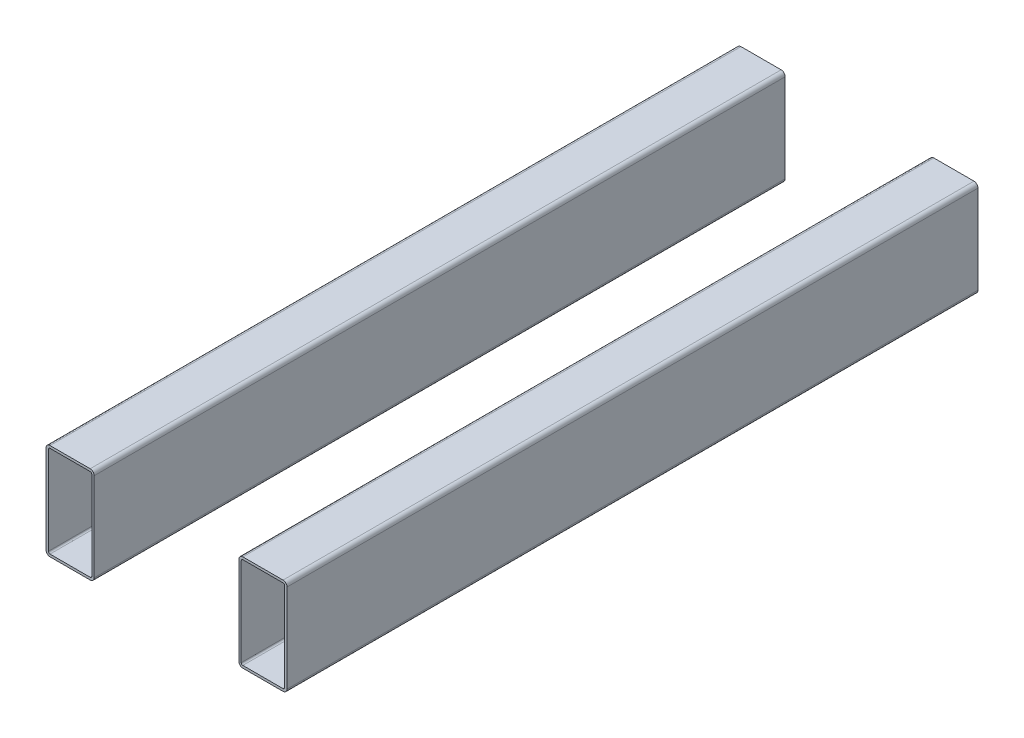
ISO-10303-21;
HEADER;
FILE_DESCRIPTION(('STEP AP214'),'2;1');
FILE_NAME('part.step','',(''),(''),'','','');
FILE_SCHEMA(('AUTOMOTIVE_DESIGN { 1 0 10303 214 1 1 1 1 }'));
ENDSEC;
DATA;
#1=APPLICATION_CONTEXT('core data for automotive mechanical design processes');
#2=APPLICATION_PROTOCOL_DEFINITION('international standard','automotive_design',2000,#1);
#3=PRODUCT_CONTEXT('',#1,'mechanical');
#4=PRODUCT('Part','Part','',(#3));
#5=PRODUCT_RELATED_PRODUCT_CATEGORY('part','',(#4));
#6=PRODUCT_DEFINITION_FORMATION('','',#4);
#7=PRODUCT_DEFINITION_CONTEXT('part definition',#1,'design');
#8=PRODUCT_DEFINITION('design','',#6,#7);
#9=PRODUCT_DEFINITION_SHAPE('','',#8);
#10=(LENGTH_UNIT() NAMED_UNIT(*) SI_UNIT(.MILLI.,.METRE.));
#11=(NAMED_UNIT(*) PLANE_ANGLE_UNIT() SI_UNIT($,.RADIAN.));
#12=(NAMED_UNIT(*) SI_UNIT($,.STERADIAN.) SOLID_ANGLE_UNIT());
#13=UNCERTAINTY_MEASURE_WITH_UNIT(LENGTH_MEASURE(1.E-05),#10,'distance_accuracy_value','');
#14=(GEOMETRIC_REPRESENTATION_CONTEXT(3) GLOBAL_UNCERTAINTY_ASSIGNED_CONTEXT((#13)) GLOBAL_UNIT_ASSIGNED_CONTEXT((#10,
#11,#12)) REPRESENTATION_CONTEXT('',''));
#15=CARTESIAN_POINT('',(0.,0.,0.));
#16=DIRECTION('',(0.,0.,1.));
#17=DIRECTION('',(1.,0.,0.));
#18=AXIS2_PLACEMENT_3D('',#15,#16,#17);
#19=CARTESIAN_POINT('',(-150.,-1294.,-564.164078649986));
#20=DIRECTION('',(-1.,0.,0.));
#21=DIRECTION('',(0.,-1.,0.));
#22=AXIS2_PLACEMENT_3D('',#19,#20,#21);
#23=PLANE('',#22);
#24=DIRECTION('',(0.,-1.,0.));
#25=VECTOR('',#24,1.);
#26=CARTESIAN_POINT('',(-150.,-1294.,-429.999999999999));
#27=LINE('',#26,#25);
#28=CARTESIAN_POINT('',(-150.,-1299.,-429.999999999999));
#29=VERTEX_POINT('',#28);
#30=CARTESIAN_POINT('',(-150.,-1409.,-429.999999999999));
#31=VERTEX_POINT('',#30);
#32=EDGE_CURVE('E247',#29,#31,#27,.T.);
#33=ORIENTED_EDGE('',*,*,#32,.T.);
#34=DIRECTION('',(0.,0.,1.));
#35=VECTOR('',#34,1.);
#36=CARTESIAN_POINT('',(-150.,-1409.,-564.164078649986));
#37=LINE('',#36,#35);
#38=CARTESIAN_POINT('',(-150.,-1409.,429.999999999999));
#39=VERTEX_POINT('',#38);
#40=EDGE_CURVE('E266',#31,#39,#37,.T.);
#41=ORIENTED_EDGE('',*,*,#40,.T.);
#42=DIRECTION('',(0.,1.,0.));
#43=VECTOR('',#42,1.);
#44=CARTESIAN_POINT('',(-150.,-1294.,429.999999999999));
#45=LINE('',#44,#43);
#46=CARTESIAN_POINT('',(-150.,-1299.,429.999999999999));
#47=VERTEX_POINT('',#46);
#48=EDGE_CURVE('E253',#39,#47,#45,.T.);
#49=ORIENTED_EDGE('',*,*,#48,.T.);
#50=DIRECTION('',(0.,0.,1.));
#51=VECTOR('',#50,1.);
#52=CARTESIAN_POINT('',(-150.,-1299.,-429.999999999999));
#53=LINE('',#52,#51);
#54=EDGE_CURVE('E256',#47,#29,#53,.F.);
#55=ORIENTED_EDGE('',*,*,#54,.T.);
#56=EDGE_LOOP('',(#33,#41,#49,#55));
#57=FACE_BOUND('',#56,.T.);
#58=ADVANCED_FACE('F71',(#57),#23,.T.);
#59=CARTESIAN_POINT('',(-150.,-1414.,-564.164078649986));
#60=DIRECTION('',(0.,-1.,0.));
#61=DIRECTION('',(0.,0.,-1.));
#62=AXIS2_PLACEMENT_3D('',#59,#60,#61);
#63=PLANE('',#62);
#64=DIRECTION('',(-1.,0.,0.));
#65=VECTOR('',#64,1.);
#66=CARTESIAN_POINT('',(-150.,-1414.,429.999999999999));
#67=LINE('',#66,#65);
#68=CARTESIAN_POINT('',(-95.,-1414.,429.999999999999));
#69=VERTEX_POINT('',#68);
#70=CARTESIAN_POINT('',(-145.,-1414.,429.999999999999));
#71=VERTEX_POINT('',#70);
#72=EDGE_CURVE('E257',#69,#71,#67,.T.);
#73=ORIENTED_EDGE('',*,*,#72,.T.);
#74=DIRECTION('',(0.,0.,1.));
#75=VECTOR('',#74,1.);
#76=CARTESIAN_POINT('',(-145.,-1414.,-564.164078649986));
#77=LINE('',#76,#75);
#78=CARTESIAN_POINT('',(-145.,-1414.,-429.999999999999));
#79=VERTEX_POINT('',#78);
#80=EDGE_CURVE('E280',#71,#79,#77,.F.);
#81=ORIENTED_EDGE('',*,*,#80,.T.);
#82=DIRECTION('',(1.,0.,0.));
#83=VECTOR('',#82,1.);
#84=CARTESIAN_POINT('',(-150.,-1414.,-429.999999999999));
#85=LINE('',#84,#83);
#86=CARTESIAN_POINT('',(-95.,-1414.,-429.999999999999));
#87=VERTEX_POINT('',#86);
#88=EDGE_CURVE('E244',#79,#87,#85,.T.);
#89=ORIENTED_EDGE('',*,*,#88,.T.);
#90=DIRECTION('',(0.,0.,1.));
#91=VECTOR('',#90,1.);
#92=CARTESIAN_POINT('',(-95.,-1414.,429.999999999999));
#93=LINE('',#92,#91);
#94=EDGE_CURVE('E277',#87,#69,#93,.T.);
#95=ORIENTED_EDGE('',*,*,#94,.T.);
#96=EDGE_LOOP('',(#73,#81,#89,#95));
#97=FACE_BOUND('',#96,.T.);
#98=ADVANCED_FACE('F365',(#97),#63,.T.);
#99=CARTESIAN_POINT('',(-90.,-1294.,-564.164078649986));
#100=DIRECTION('',(-1.,0.,0.));
#101=DIRECTION('',(0.,-1.,0.));
#102=AXIS2_PLACEMENT_3D('',#99,#100,#101);
#103=PLANE('',#102);
#104=DIRECTION('',(0.,1.,0.));
#105=VECTOR('',#104,1.);
#106=CARTESIAN_POINT('',(-90.,-1294.,429.999999999999));
#107=LINE('',#106,#105);
#108=CARTESIAN_POINT('',(-90.,-1409.,429.999999999999));
#109=VERTEX_POINT('',#108);
#110=CARTESIAN_POINT('',(-90.,-1299.,429.999999999999));
#111=VERTEX_POINT('',#110);
#112=EDGE_CURVE('E258',#109,#111,#107,.T.);
#113=ORIENTED_EDGE('',*,*,#112,.F.);
#114=DIRECTION('',(0.,0.,1.));
#115=VECTOR('',#114,1.);
#116=CARTESIAN_POINT('',(-90.,-1409.,-429.999999999999));
#117=LINE('',#116,#115);
#118=CARTESIAN_POINT('',(-90.,-1409.,-429.999999999999));
#119=VERTEX_POINT('',#118);
#120=EDGE_CURVE('E293',#109,#119,#117,.F.);
#121=ORIENTED_EDGE('',*,*,#120,.T.);
#122=DIRECTION('',(0.,-1.,0.));
#123=VECTOR('',#122,1.);
#124=CARTESIAN_POINT('',(-90.,-1294.,-429.999999999999));
#125=LINE('',#124,#123);
#126=CARTESIAN_POINT('',(-90.,-1299.,-429.999999999999));
#127=VERTEX_POINT('',#126);
#128=EDGE_CURVE('E243',#127,#119,#125,.T.);
#129=ORIENTED_EDGE('',*,*,#128,.F.);
#130=DIRECTION('',(0.,0.,1.));
#131=VECTOR('',#130,1.);
#132=CARTESIAN_POINT('',(-90.,-1299.,-564.164078649986));
#133=LINE('',#132,#131);
#134=EDGE_CURVE('E290',#127,#111,#133,.T.);
#135=ORIENTED_EDGE('',*,*,#134,.T.);
#136=EDGE_LOOP('',(#113,#121,#129,#135));
#137=FACE_BOUND('',#136,.T.);
#138=ADVANCED_FACE('F361',(#137),#103,.F.);
#139=CARTESIAN_POINT('',(-150.,-1294.,-564.164078649986));
#140=DIRECTION('',(0.,-1.,0.));
#141=DIRECTION('',(0.,0.,-1.));
#142=AXIS2_PLACEMENT_3D('',#139,#140,#141);
#143=PLANE('',#142);
#144=DIRECTION('',(1.,0.,0.));
#145=VECTOR('',#144,1.);
#146=CARTESIAN_POINT('',(-150.,-1294.,-429.999999999999));
#147=LINE('',#146,#145);
#148=CARTESIAN_POINT('',(-145.,-1294.,-429.999999999999));
#149=VERTEX_POINT('',#148);
#150=CARTESIAN_POINT('',(-95.,-1294.,-429.999999999999));
#151=VERTEX_POINT('',#150);
#152=EDGE_CURVE('E223',#149,#151,#147,.T.);
#153=ORIENTED_EDGE('',*,*,#152,.F.);
#154=DIRECTION('',(0.,0.,1.));
#155=VECTOR('',#154,1.);
#156=CARTESIAN_POINT('',(-145.,-1294.,429.999999999999));
#157=LINE('',#156,#155);
#158=CARTESIAN_POINT('',(-145.,-1294.,429.999999999999));
#159=VERTEX_POINT('',#158);
#160=EDGE_CURVE('E297',#149,#159,#157,.T.);
#161=ORIENTED_EDGE('',*,*,#160,.T.);
#162=DIRECTION('',(-1.,0.,0.));
#163=VECTOR('',#162,1.);
#164=CARTESIAN_POINT('',(-150.,-1294.,429.999999999999));
#165=LINE('',#164,#163);
#166=CARTESIAN_POINT('',(-95.,-1294.,429.999999999999));
#167=VERTEX_POINT('',#166);
#168=EDGE_CURVE('E250',#167,#159,#165,.T.);
#169=ORIENTED_EDGE('',*,*,#168,.F.);
#170=DIRECTION('',(0.,0.,1.));
#171=VECTOR('',#170,1.);
#172=CARTESIAN_POINT('',(-95.,-1294.,-564.164078649986));
#173=LINE('',#172,#171);
#174=EDGE_CURVE('E295',#167,#151,#173,.F.);
#175=ORIENTED_EDGE('',*,*,#174,.T.);
#176=EDGE_LOOP('',(#153,#161,#169,#175));
#177=FACE_BOUND('',#176,.T.);
#178=ADVANCED_FACE('F330',(#177),#143,.F.);
#179=CARTESIAN_POINT('',(1.73275416638304E-05,-1429.,-429.999999999999));
#180=DIRECTION('',(0.,0.,-1.));
#181=DIRECTION('',(-1.,0.,0.));
#182=AXIS2_PLACEMENT_3D('',#179,#180,#181);
#183=PLANE('',#182);
#184=CARTESIAN_POINT('',(-95.,-1409.,-429.999999999999));
#185=DIRECTION('',(0.,0.,-1.));
#186=DIRECTION('',(-1.,0.,0.));
#187=AXIS2_PLACEMENT_3D('',#184,#185,#186);
#188=CIRCLE('',#187,2.);
#189=CARTESIAN_POINT('',(-93.,-1409.,-429.999999999999));
#190=VERTEX_POINT('',#189);
#191=CARTESIAN_POINT('',(-95.,-1411.,-429.999999999999));
#192=VERTEX_POINT('',#191);
#193=EDGE_CURVE('E188',#190,#192,#188,.T.);
#194=ORIENTED_EDGE('',*,*,#193,.F.);
#195=DIRECTION('',(0.,-1.,0.));
#196=VECTOR('',#195,1.);
#197=CARTESIAN_POINT('',(-93.0000000000001,-1299.,-429.999999999999));
#198=LINE('',#197,#196);
#199=CARTESIAN_POINT('',(-93.,-1299.,-429.999999999999));
#200=VERTEX_POINT('',#199);
#201=EDGE_CURVE('E204',#200,#190,#198,.T.);
#202=ORIENTED_EDGE('',*,*,#201,.F.);
#203=CARTESIAN_POINT('',(-95.,-1299.,-429.999999999999));
#204=DIRECTION('',(0.,0.,-1.));
#205=DIRECTION('',(-1.,0.,0.));
#206=AXIS2_PLACEMENT_3D('',#203,#204,#205);
#207=CIRCLE('',#206,1.99999999999997);
#208=CARTESIAN_POINT('',(-95.,-1297.,-429.999999999999));
#209=VERTEX_POINT('',#208);
#210=EDGE_CURVE('E207',#209,#200,#207,.T.);
#211=ORIENTED_EDGE('',*,*,#210,.F.);
#212=DIRECTION('',(1.,0.,0.));
#213=VECTOR('',#212,1.);
#214=CARTESIAN_POINT('',(-145.,-1297.,-429.999999999999));
#215=LINE('',#214,#213);
#216=CARTESIAN_POINT('',(-145.,-1297.,-429.999999999999));
#217=VERTEX_POINT('',#216);
#218=EDGE_CURVE('E236',#217,#209,#215,.T.);
#219=ORIENTED_EDGE('',*,*,#218,.F.);
#220=CARTESIAN_POINT('',(-145.,-1299.,-429.999999999999));
#221=DIRECTION('',(0.,0.,-1.));
#222=DIRECTION('',(-1.,0.,0.));
#223=AXIS2_PLACEMENT_3D('',#220,#221,#222);
#224=CIRCLE('',#223,2.);
#225=CARTESIAN_POINT('',(-147.,-1299.,-429.999999999999));
#226=VERTEX_POINT('',#225);
#227=EDGE_CURVE('E233',#226,#217,#224,.T.);
#228=ORIENTED_EDGE('',*,*,#227,.F.);
#229=DIRECTION('',(0.,1.,0.));
#230=VECTOR('',#229,1.);
#231=CARTESIAN_POINT('',(-147.,-1409.,-429.999999999999));
#232=LINE('',#231,#230);
#233=CARTESIAN_POINT('',(-147.,-1409.,-429.999999999999));
#234=VERTEX_POINT('',#233);
#235=EDGE_CURVE('E230',#234,#226,#232,.T.);
#236=ORIENTED_EDGE('',*,*,#235,.F.);
#237=CARTESIAN_POINT('',(-145.,-1409.,-429.999999999999));
#238=DIRECTION('',(0.,0.,-1.));
#239=DIRECTION('',(-1.,0.,0.));
#240=AXIS2_PLACEMENT_3D('',#237,#238,#239);
#241=CIRCLE('',#240,1.99999999999997);
#242=CARTESIAN_POINT('',(-145.,-1411.,-429.999999999999));
#243=VERTEX_POINT('',#242);
#244=EDGE_CURVE('E227',#243,#234,#241,.T.);
#245=ORIENTED_EDGE('',*,*,#244,.F.);
#246=DIRECTION('',(-1.,0.,0.));
#247=VECTOR('',#246,1.);
#248=CARTESIAN_POINT('',(-95.,-1411.,-429.999999999999));
#249=LINE('',#248,#247);
#250=EDGE_CURVE('E225',#192,#243,#249,.T.);
#251=ORIENTED_EDGE('',*,*,#250,.F.);
#252=EDGE_LOOP('',(#194,#202,#211,#219,#228,#236,#245,#251));
#253=FACE_BOUND('',#252,.T.);
#254=ORIENTED_EDGE('',*,*,#88,.F.);
#255=CARTESIAN_POINT('',(-145.,-1409.,-429.999999999999));
#256=DIRECTION('',(0.,0.,-1.));
#257=DIRECTION('',(-1.,0.,0.));
#258=AXIS2_PLACEMENT_3D('',#255,#256,#257);
#259=CIRCLE('',#258,5.);
#260=EDGE_CURVE('E288',#79,#31,#259,.T.);
#261=ORIENTED_EDGE('',*,*,#260,.T.);
#262=ORIENTED_EDGE('',*,*,#32,.F.);
#263=CARTESIAN_POINT('',(-145.,-1299.,-429.999999999999));
#264=DIRECTION('',(0.,0.,-1.));
#265=DIRECTION('',(-1.,0.,0.));
#266=AXIS2_PLACEMENT_3D('',#263,#264,#265);
#267=CIRCLE('',#266,5.);
#268=EDGE_CURVE('E284',#29,#149,#267,.T.);
#269=ORIENTED_EDGE('',*,*,#268,.T.);
#270=ORIENTED_EDGE('',*,*,#152,.T.);
#271=CARTESIAN_POINT('',(-95.,-1299.,-429.999999999999));
#272=DIRECTION('',(0.,0.,-1.));
#273=DIRECTION('',(-1.,0.,0.));
#274=AXIS2_PLACEMENT_3D('',#271,#272,#273);
#275=CIRCLE('',#274,5.);
#276=EDGE_CURVE('E282',#151,#127,#275,.T.);
#277=ORIENTED_EDGE('',*,*,#276,.T.);
#278=ORIENTED_EDGE('',*,*,#128,.T.);
#279=CARTESIAN_POINT('',(-95.,-1409.,-429.999999999999));
#280=DIRECTION('',(0.,0.,-1.));
#281=DIRECTION('',(-1.,0.,0.));
#282=AXIS2_PLACEMENT_3D('',#279,#280,#281);
#283=CIRCLE('',#282,5.);
#284=EDGE_CURVE('E286',#119,#87,#283,.T.);
#285=ORIENTED_EDGE('',*,*,#284,.T.);
#286=EDGE_LOOP('',(#254,#261,#262,#269,#270,#277,#278,#285));
#287=FACE_BOUND('',#286,.T.);
#288=ADVANCED_FACE('F327',(#253,#287),#183,.T.);
#289=CARTESIAN_POINT('',(1.73275416638304E-05,-1429.,429.999999999999));
#290=DIRECTION('',(0.,0.,-1.));
#291=DIRECTION('',(-1.,0.,0.));
#292=AXIS2_PLACEMENT_3D('',#289,#290,#291);
#293=PLANE('',#292);
#294=DIRECTION('',(0.,-1.,0.));
#295=VECTOR('',#294,1.);
#296=CARTESIAN_POINT('',(-93.0000000000001,-1299.,429.999999999999));
#297=LINE('',#296,#295);
#298=CARTESIAN_POINT('',(-93.,-1299.,429.999999999999));
#299=VERTEX_POINT('',#298);
#300=CARTESIAN_POINT('',(-93.,-1409.,429.999999999999));
#301=VERTEX_POINT('',#300);
#302=EDGE_CURVE('E203',#299,#301,#297,.T.);
#303=ORIENTED_EDGE('',*,*,#302,.T.);
#304=CARTESIAN_POINT('',(-95.,-1409.,429.999999999999));
#305=DIRECTION('',(0.,0.,-1.));
#306=DIRECTION('',(-1.,0.,0.));
#307=AXIS2_PLACEMENT_3D('',#304,#305,#306);
#308=CIRCLE('',#307,2.);
#309=CARTESIAN_POINT('',(-95.,-1411.,429.999999999999));
#310=VERTEX_POINT('',#309);
#311=EDGE_CURVE('E185',#301,#310,#308,.T.);
#312=ORIENTED_EDGE('',*,*,#311,.T.);
#313=DIRECTION('',(-1.,0.,0.));
#314=VECTOR('',#313,1.);
#315=CARTESIAN_POINT('',(-95.,-1411.,429.999999999999));
#316=LINE('',#315,#314);
#317=CARTESIAN_POINT('',(-145.,-1411.,429.999999999999));
#318=VERTEX_POINT('',#317);
#319=EDGE_CURVE('E193',#310,#318,#316,.T.);
#320=ORIENTED_EDGE('',*,*,#319,.T.);
#321=CARTESIAN_POINT('',(-145.,-1409.,429.999999999999));
#322=DIRECTION('',(0.,0.,-1.));
#323=DIRECTION('',(-1.,0.,0.));
#324=AXIS2_PLACEMENT_3D('',#321,#322,#323);
#325=CIRCLE('',#324,1.99999999999997);
#326=CARTESIAN_POINT('',(-147.,-1409.,429.999999999999));
#327=VERTEX_POINT('',#326);
#328=EDGE_CURVE('E197',#318,#327,#325,.T.);
#329=ORIENTED_EDGE('',*,*,#328,.T.);
#330=DIRECTION('',(0.,1.,0.));
#331=VECTOR('',#330,1.);
#332=CARTESIAN_POINT('',(-147.,-1409.,429.999999999999));
#333=LINE('',#332,#331);
#334=CARTESIAN_POINT('',(-147.,-1299.,429.999999999999));
#335=VERTEX_POINT('',#334);
#336=EDGE_CURVE('E211',#327,#335,#333,.T.);
#337=ORIENTED_EDGE('',*,*,#336,.T.);
#338=CARTESIAN_POINT('',(-145.,-1299.,429.999999999999));
#339=DIRECTION('',(0.,0.,-1.));
#340=DIRECTION('',(-1.,0.,0.));
#341=AXIS2_PLACEMENT_3D('',#338,#339,#340);
#342=CIRCLE('',#341,2.);
#343=CARTESIAN_POINT('',(-145.,-1297.,429.999999999999));
#344=VERTEX_POINT('',#343);
#345=EDGE_CURVE('E214',#335,#344,#342,.T.);
#346=ORIENTED_EDGE('',*,*,#345,.T.);
#347=DIRECTION('',(1.,0.,0.));
#348=VECTOR('',#347,1.);
#349=CARTESIAN_POINT('',(-145.,-1297.,429.999999999999));
#350=LINE('',#349,#348);
#351=CARTESIAN_POINT('',(-95.,-1297.,429.999999999999));
#352=VERTEX_POINT('',#351);
#353=EDGE_CURVE('E217',#344,#352,#350,.T.);
#354=ORIENTED_EDGE('',*,*,#353,.T.);
#355=CARTESIAN_POINT('',(-95.,-1299.,429.999999999999));
#356=DIRECTION('',(0.,0.,-1.));
#357=DIRECTION('',(-1.,0.,0.));
#358=AXIS2_PLACEMENT_3D('',#355,#356,#357);
#359=CIRCLE('',#358,1.99999999999997);
#360=EDGE_CURVE('E220',#352,#299,#359,.T.);
#361=ORIENTED_EDGE('',*,*,#360,.T.);
#362=EDGE_LOOP('',(#303,#312,#320,#329,#337,#346,#354,#361));
#363=FACE_BOUND('',#362,.T.);
#364=ORIENTED_EDGE('',*,*,#48,.F.);
#365=CARTESIAN_POINT('',(-145.,-1409.,429.999999999999));
#366=DIRECTION('',(0.,0.,-1.));
#367=DIRECTION('',(-1.,0.,0.));
#368=AXIS2_PLACEMENT_3D('',#365,#366,#367);
#369=CIRCLE('',#368,5.);
#370=EDGE_CURVE('E275',#39,#71,#369,.F.);
#371=ORIENTED_EDGE('',*,*,#370,.T.);
#372=ORIENTED_EDGE('',*,*,#72,.F.);
#373=CARTESIAN_POINT('',(-95.,-1409.,429.999999999999));
#374=DIRECTION('',(0.,0.,-1.));
#375=DIRECTION('',(-1.,0.,0.));
#376=AXIS2_PLACEMENT_3D('',#373,#374,#375);
#377=CIRCLE('',#376,5.);
#378=EDGE_CURVE('E273',#69,#109,#377,.F.);
#379=ORIENTED_EDGE('',*,*,#378,.T.);
#380=ORIENTED_EDGE('',*,*,#112,.T.);
#381=CARTESIAN_POINT('',(-95.,-1299.,429.999999999999));
#382=DIRECTION('',(0.,0.,-1.));
#383=DIRECTION('',(-1.,0.,0.));
#384=AXIS2_PLACEMENT_3D('',#381,#382,#383);
#385=CIRCLE('',#384,5.);
#386=EDGE_CURVE('E269',#111,#167,#385,.F.);
#387=ORIENTED_EDGE('',*,*,#386,.T.);
#388=ORIENTED_EDGE('',*,*,#168,.T.);
#389=CARTESIAN_POINT('',(-145.,-1299.,429.999999999999));
#390=DIRECTION('',(0.,0.,-1.));
#391=DIRECTION('',(-1.,0.,0.));
#392=AXIS2_PLACEMENT_3D('',#389,#390,#391);
#393=CIRCLE('',#392,5.);
#394=EDGE_CURVE('E271',#159,#47,#393,.F.);
#395=ORIENTED_EDGE('',*,*,#394,.T.);
#396=EDGE_LOOP('',(#364,#371,#372,#379,#380,#387,#388,#395));
#397=FACE_BOUND('',#396,.T.);
#398=ADVANCED_FACE('F199',(#363,#397),#293,.F.);
#399=CARTESIAN_POINT('',(-145.,-1409.,-564.164078649986));
#400=DIRECTION('',(0.,0.,1.));
#401=DIRECTION('',(1.,0.,0.));
#402=AXIS2_PLACEMENT_3D('',#399,#400,#401);
#403=CYLINDRICAL_SURFACE('',#402,5.);
#404=ORIENTED_EDGE('',*,*,#260,.F.);
#405=ORIENTED_EDGE('',*,*,#80,.F.);
#406=ORIENTED_EDGE('',*,*,#370,.F.);
#407=ORIENTED_EDGE('',*,*,#40,.F.);
#408=EDGE_LOOP('',(#404,#405,#406,#407));
#409=FACE_BOUND('',#408,.T.);
#410=ADVANCED_FACE('F341',(#409),#403,.T.);
#411=CARTESIAN_POINT('',(-95.,-1409.,-564.164078649986));
#412=DIRECTION('',(0.,0.,-1.));
#413=DIRECTION('',(-1.,0.,0.));
#414=AXIS2_PLACEMENT_3D('',#411,#412,#413);
#415=CYLINDRICAL_SURFACE('',#414,5.);
#416=ORIENTED_EDGE('',*,*,#284,.F.);
#417=ORIENTED_EDGE('',*,*,#120,.F.);
#418=ORIENTED_EDGE('',*,*,#378,.F.);
#419=ORIENTED_EDGE('',*,*,#94,.F.);
#420=EDGE_LOOP('',(#416,#417,#418,#419));
#421=FACE_BOUND('',#420,.T.);
#422=ADVANCED_FACE('F364',(#421),#415,.T.);
#423=CARTESIAN_POINT('',(-145.,-1299.,-564.164078649986));
#424=DIRECTION('',(0.,0.,-1.));
#425=DIRECTION('',(-1.,0.,0.));
#426=AXIS2_PLACEMENT_3D('',#423,#424,#425);
#427=CYLINDRICAL_SURFACE('',#426,5.);
#428=ORIENTED_EDGE('',*,*,#268,.F.);
#429=ORIENTED_EDGE('',*,*,#54,.F.);
#430=ORIENTED_EDGE('',*,*,#394,.F.);
#431=ORIENTED_EDGE('',*,*,#160,.F.);
#432=EDGE_LOOP('',(#428,#429,#430,#431));
#433=FACE_BOUND('',#432,.T.);
#434=ADVANCED_FACE('F350',(#433),#427,.T.);
#435=CARTESIAN_POINT('',(-95.,-1299.,-564.164078649986));
#436=DIRECTION('',(0.,0.,1.));
#437=DIRECTION('',(1.,0.,0.));
#438=AXIS2_PLACEMENT_3D('',#435,#436,#437);
#439=CYLINDRICAL_SURFACE('',#438,5.);
#440=ORIENTED_EDGE('',*,*,#276,.F.);
#441=ORIENTED_EDGE('',*,*,#174,.F.);
#442=ORIENTED_EDGE('',*,*,#386,.F.);
#443=ORIENTED_EDGE('',*,*,#134,.F.);
#444=EDGE_LOOP('',(#440,#441,#442,#443));
#445=FACE_BOUND('',#444,.T.);
#446=ADVANCED_FACE('F358',(#445),#439,.T.);
#447=CARTESIAN_POINT('',(-147.,-1294.,-564.164078649986));
#448=DIRECTION('',(-1.,0.,0.));
#449=DIRECTION('',(0.,-1.,0.));
#450=AXIS2_PLACEMENT_3D('',#447,#448,#449);
#451=PLANE('',#450);
#452=DIRECTION('',(0.,0.,1.));
#453=VECTOR('',#452,1.);
#454=CARTESIAN_POINT('',(-147.,-1409.,-564.164078649986));
#455=LINE('',#454,#453);
#456=EDGE_CURVE('E75',#234,#327,#455,.T.);
#457=ORIENTED_EDGE('',*,*,#456,.F.);
#458=ORIENTED_EDGE('',*,*,#235,.T.);
#459=DIRECTION('',(0.,0.,1.));
#460=VECTOR('',#459,1.);
#461=CARTESIAN_POINT('',(-147.,-1299.,-564.164078649986));
#462=LINE('',#461,#460);
#463=EDGE_CURVE('E304',#335,#226,#462,.F.);
#464=ORIENTED_EDGE('',*,*,#463,.F.);
#465=ORIENTED_EDGE('',*,*,#336,.F.);
#466=EDGE_LOOP('',(#457,#458,#464,#465));
#467=FACE_BOUND('',#466,.T.);
#468=ADVANCED_FACE('F313',(#467),#451,.F.);
#469=CARTESIAN_POINT('',(-150.,-1411.,-564.164078649986));
#470=DIRECTION('',(0.,-1.,0.));
#471=DIRECTION('',(0.,0.,-1.));
#472=AXIS2_PLACEMENT_3D('',#469,#470,#471);
#473=PLANE('',#472);
#474=DIRECTION('',(0.,0.,-1.));
#475=VECTOR('',#474,1.);
#476=CARTESIAN_POINT('',(-145.,-1411.,-564.164078649986));
#477=LINE('',#476,#475);
#478=EDGE_CURVE('E93',#318,#243,#477,.T.);
#479=ORIENTED_EDGE('',*,*,#478,.F.);
#480=ORIENTED_EDGE('',*,*,#319,.F.);
#481=DIRECTION('',(0.,0.,-1.));
#482=VECTOR('',#481,1.);
#483=CARTESIAN_POINT('',(-95.,-1411.,-564.164078649986));
#484=LINE('',#483,#482);
#485=EDGE_CURVE('E88',#192,#310,#484,.F.);
#486=ORIENTED_EDGE('',*,*,#485,.F.);
#487=ORIENTED_EDGE('',*,*,#250,.T.);
#488=EDGE_LOOP('',(#479,#480,#486,#487));
#489=FACE_BOUND('',#488,.T.);
#490=ADVANCED_FACE('F194',(#489),#473,.F.);
#491=CARTESIAN_POINT('',(-93.,-1294.,-564.164078649986));
#492=DIRECTION('',(-1.,0.,0.));
#493=DIRECTION('',(0.,-1.,0.));
#494=AXIS2_PLACEMENT_3D('',#491,#492,#493);
#495=PLANE('',#494);
#496=DIRECTION('',(0.,0.,1.));
#497=VECTOR('',#496,1.);
#498=CARTESIAN_POINT('',(-93.,-1409.,-564.164078649986));
#499=LINE('',#498,#497);
#500=EDGE_CURVE('E190',#301,#190,#499,.F.);
#501=ORIENTED_EDGE('',*,*,#500,.F.);
#502=ORIENTED_EDGE('',*,*,#302,.F.);
#503=DIRECTION('',(0.,0.,1.));
#504=VECTOR('',#503,1.);
#505=CARTESIAN_POINT('',(-93.,-1299.,-564.164078649986));
#506=LINE('',#505,#504);
#507=EDGE_CURVE('E301',#200,#299,#506,.T.);
#508=ORIENTED_EDGE('',*,*,#507,.F.);
#509=ORIENTED_EDGE('',*,*,#201,.T.);
#510=EDGE_LOOP('',(#501,#502,#508,#509));
#511=FACE_BOUND('',#510,.T.);
#512=ADVANCED_FACE('F325',(#511),#495,.T.);
#513=CARTESIAN_POINT('',(-150.,-1297.,-564.164078649986));
#514=DIRECTION('',(0.,-1.,0.));
#515=DIRECTION('',(0.,0.,-1.));
#516=AXIS2_PLACEMENT_3D('',#513,#514,#515);
#517=PLANE('',#516);
#518=DIRECTION('',(0.,0.,-1.));
#519=VECTOR('',#518,1.);
#520=CARTESIAN_POINT('',(-145.,-1297.,-564.164078649986));
#521=LINE('',#520,#519);
#522=EDGE_CURVE('E80',#217,#344,#521,.F.);
#523=ORIENTED_EDGE('',*,*,#522,.F.);
#524=ORIENTED_EDGE('',*,*,#218,.T.);
#525=DIRECTION('',(0.,0.,-1.));
#526=VECTOR('',#525,1.);
#527=CARTESIAN_POINT('',(-95.,-1297.,-564.164078649986));
#528=LINE('',#527,#526);
#529=EDGE_CURVE('E13',#352,#209,#528,.T.);
#530=ORIENTED_EDGE('',*,*,#529,.F.);
#531=ORIENTED_EDGE('',*,*,#353,.F.);
#532=EDGE_LOOP('',(#523,#524,#530,#531));
#533=FACE_BOUND('',#532,.T.);
#534=ADVANCED_FACE('F319',(#533),#517,.T.);
#535=CARTESIAN_POINT('',(-145.,-1409.,-564.164078649986));
#536=DIRECTION('',(0.,0.,1.));
#537=DIRECTION('',(1.,0.,0.));
#538=AXIS2_PLACEMENT_3D('',#535,#536,#537);
#539=CYLINDRICAL_SURFACE('',#538,2.);
#540=ORIENTED_EDGE('',*,*,#478,.T.);
#541=ORIENTED_EDGE('',*,*,#244,.T.);
#542=ORIENTED_EDGE('',*,*,#456,.T.);
#543=ORIENTED_EDGE('',*,*,#328,.F.);
#544=EDGE_LOOP('',(#540,#541,#542,#543));
#545=FACE_BOUND('',#544,.T.);
#546=ADVANCED_FACE('F309',(#545),#539,.F.);
#547=CARTESIAN_POINT('',(-95.,-1409.,-564.164078649986));
#548=DIRECTION('',(0.,0.,-1.));
#549=DIRECTION('',(-1.,0.,0.));
#550=AXIS2_PLACEMENT_3D('',#547,#548,#549);
#551=CYLINDRICAL_SURFACE('',#550,2.);
#552=ORIENTED_EDGE('',*,*,#500,.T.);
#553=ORIENTED_EDGE('',*,*,#193,.T.);
#554=ORIENTED_EDGE('',*,*,#485,.T.);
#555=ORIENTED_EDGE('',*,*,#311,.F.);
#556=EDGE_LOOP('',(#552,#553,#554,#555));
#557=FACE_BOUND('',#556,.T.);
#558=ADVANCED_FACE('F183',(#557),#551,.F.);
#559=CARTESIAN_POINT('',(-145.,-1299.,-564.164078649986));
#560=DIRECTION('',(0.,0.,-1.));
#561=DIRECTION('',(-1.,0.,0.));
#562=AXIS2_PLACEMENT_3D('',#559,#560,#561);
#563=CYLINDRICAL_SURFACE('',#562,2.);
#564=ORIENTED_EDGE('',*,*,#463,.T.);
#565=ORIENTED_EDGE('',*,*,#227,.T.);
#566=ORIENTED_EDGE('',*,*,#522,.T.);
#567=ORIENTED_EDGE('',*,*,#345,.F.);
#568=EDGE_LOOP('',(#564,#565,#566,#567));
#569=FACE_BOUND('',#568,.T.);
#570=ADVANCED_FACE('F315',(#569),#563,.F.);
#571=CARTESIAN_POINT('',(-95.,-1299.,-564.164078649986));
#572=DIRECTION('',(0.,0.,1.));
#573=DIRECTION('',(1.,0.,0.));
#574=AXIS2_PLACEMENT_3D('',#571,#572,#573);
#575=CYLINDRICAL_SURFACE('',#574,2.);
#576=ORIENTED_EDGE('',*,*,#529,.T.);
#577=ORIENTED_EDGE('',*,*,#210,.T.);
#578=ORIENTED_EDGE('',*,*,#507,.T.);
#579=ORIENTED_EDGE('',*,*,#360,.F.);
#580=EDGE_LOOP('',(#576,#577,#578,#579));
#581=FACE_BOUND('',#580,.T.);
#582=ADVANCED_FACE('F73',(#581),#575,.F.);
#583=CLOSED_SHELL('',(#58,#98,#138,#178,#288,#398,#410,#422,#434,#446,#468,#490,#512,#534,#546,
#558,#570,#582));
#584=MANIFOLD_SOLID_BREP('B2',#583);
#585=CARTESIAN_POINT('',(0.,-1294.,-564.164078649986));
#586=DIRECTION('',(0.,1.,0.));
#587=DIRECTION('',(0.,0.,1.));
#588=AXIS2_PLACEMENT_3D('',#585,#586,#587);
#589=PLANE('',#588);
#590=DIRECTION('',(1.,0.,0.));
#591=VECTOR('',#590,1.);
#592=CARTESIAN_POINT('',(0.,-1294.,429.999999999999));
#593=LINE('',#592,#591);
#594=CARTESIAN_POINT('',(95.0000000000003,-1294.,429.999999999999));
#595=VERTEX_POINT('',#594);
#596=CARTESIAN_POINT('',(145.,-1294.,429.999999999999));
#597=VERTEX_POINT('',#596);
#598=EDGE_CURVE('E683',#595,#597,#593,.T.);
#599=ORIENTED_EDGE('',*,*,#598,.T.);
#600=DIRECTION('',(0.,0.,1.));
#601=VECTOR('',#600,1.);
#602=CARTESIAN_POINT('',(145.,-1294.,-429.999999999999));
#603=LINE('',#602,#601);
#604=CARTESIAN_POINT('',(145.,-1294.,-429.999999999999));
#605=VERTEX_POINT('',#604);
#606=EDGE_CURVE('E758',#597,#605,#603,.F.);
#607=ORIENTED_EDGE('',*,*,#606,.T.);
#608=DIRECTION('',(-1.,0.,0.));
#609=VECTOR('',#608,1.);
#610=CARTESIAN_POINT('',(0.,-1294.,-429.999999999999));
#611=LINE('',#610,#609);
#612=CARTESIAN_POINT('',(95.0000000000003,-1294.,-429.999999999999));
#613=VERTEX_POINT('',#612);
#614=EDGE_CURVE('E707',#605,#613,#611,.T.);
#615=ORIENTED_EDGE('',*,*,#614,.T.);
#616=DIRECTION('',(0.,0.,1.));
#617=VECTOR('',#616,1.);
#618=CARTESIAN_POINT('',(95.0000000000003,-1294.,-564.164078649986));
#619=LINE('',#618,#617);
#620=EDGE_CURVE('E755',#613,#595,#619,.T.);
#621=ORIENTED_EDGE('',*,*,#620,.T.);
#622=EDGE_LOOP('',(#599,#607,#615,#621));
#623=FACE_BOUND('',#622,.T.);
#624=ADVANCED_FACE('F532',(#623),#589,.T.);
#625=CARTESIAN_POINT('',(90.0000000000003,0.,-564.164078649986));
#626=DIRECTION('',(-1.,0.,0.));
#627=DIRECTION('',(0.,0.,1.));
#628=AXIS2_PLACEMENT_3D('',#625,#626,#627);
#629=PLANE('',#628);
#630=DIRECTION('',(0.,-1.,0.));
#631=VECTOR('',#630,1.);
#632=CARTESIAN_POINT('',(90.0000000000003,0.,-429.999999999999));
#633=LINE('',#632,#631);
#634=CARTESIAN_POINT('',(90.0000000000003,-1299.,-429.999999999999));
#635=VERTEX_POINT('',#634);
#636=CARTESIAN_POINT('',(90.0000000000003,-1409.,-429.999999999999));
#637=VERTEX_POINT('',#636);
#638=EDGE_CURVE('E713',#635,#637,#633,.T.);
#639=ORIENTED_EDGE('',*,*,#638,.T.);
#640=DIRECTION('',(0.,0.,1.));
#641=VECTOR('',#640,1.);
#642=CARTESIAN_POINT('',(90.0000000000003,-1409.,429.999999999999));
#643=LINE('',#642,#641);
#644=CARTESIAN_POINT('',(90.0000000000003,-1409.,429.999999999999));
#645=VERTEX_POINT('',#644);
#646=EDGE_CURVE('E726',#637,#645,#643,.T.);
#647=ORIENTED_EDGE('',*,*,#646,.T.);
#648=DIRECTION('',(0.,1.,0.));
#649=VECTOR('',#648,1.);
#650=CARTESIAN_POINT('',(90.0000000000003,0.,429.999999999999));
#651=LINE('',#650,#649);
#652=CARTESIAN_POINT('',(90.0000000000003,-1299.,429.999999999999));
#653=VERTEX_POINT('',#652);
#654=EDGE_CURVE('E703',#645,#653,#651,.T.);
#655=ORIENTED_EDGE('',*,*,#654,.T.);
#656=DIRECTION('',(0.,0.,1.));
#657=VECTOR('',#656,1.);
#658=CARTESIAN_POINT('',(90.0000000000003,-1299.,-564.164078649986));
#659=LINE('',#658,#657);
#660=EDGE_CURVE('E720',#653,#635,#659,.F.);
#661=ORIENTED_EDGE('',*,*,#660,.T.);
#662=EDGE_LOOP('',(#639,#647,#655,#661));
#663=FACE_BOUND('',#662,.T.);
#664=ADVANCED_FACE('F799',(#663),#629,.T.);
#665=CARTESIAN_POINT('',(0.,-1414.,-564.164078649986));
#666=DIRECTION('',(0.,1.,0.));
#667=DIRECTION('',(0.,0.,1.));
#668=AXIS2_PLACEMENT_3D('',#665,#666,#667);
#669=PLANE('',#668);
#670=DIRECTION('',(1.,0.,0.));
#671=VECTOR('',#670,1.);
#672=CARTESIAN_POINT('',(0.,-1414.,429.999999999999));
#673=LINE('',#672,#671);
#674=CARTESIAN_POINT('',(95.0000000000003,-1414.,429.999999999999));
#675=VERTEX_POINT('',#674);
#676=CARTESIAN_POINT('',(145.,-1414.,429.999999999999));
#677=VERTEX_POINT('',#676);
#678=EDGE_CURVE('E704',#675,#677,#673,.T.);
#679=ORIENTED_EDGE('',*,*,#678,.F.);
#680=DIRECTION('',(0.,0.,1.));
#681=VECTOR('',#680,1.);
#682=CARTESIAN_POINT('',(95.0000000000003,-1414.,-429.999999999999));
#683=LINE('',#682,#681);
#684=CARTESIAN_POINT('',(95.0000000000003,-1414.,-429.999999999999));
#685=VERTEX_POINT('',#684);
#686=EDGE_CURVE('E740',#675,#685,#683,.F.);
#687=ORIENTED_EDGE('',*,*,#686,.T.);
#688=DIRECTION('',(-1.,0.,0.));
#689=VECTOR('',#688,1.);
#690=CARTESIAN_POINT('',(0.,-1414.,-429.999999999999));
#691=LINE('',#690,#689);
#692=CARTESIAN_POINT('',(145.,-1414.,-429.999999999999));
#693=VERTEX_POINT('',#692);
#694=EDGE_CURVE('E716',#693,#685,#691,.T.);
#695=ORIENTED_EDGE('',*,*,#694,.F.);
#696=DIRECTION('',(0.,0.,1.));
#697=VECTOR('',#696,1.);
#698=CARTESIAN_POINT('',(145.,-1414.,-564.164078649986));
#699=LINE('',#698,#697);
#700=EDGE_CURVE('E737',#693,#677,#699,.T.);
#701=ORIENTED_EDGE('',*,*,#700,.T.);
#702=EDGE_LOOP('',(#679,#687,#695,#701));
#703=FACE_BOUND('',#702,.T.);
#704=ADVANCED_FACE('F805',(#703),#669,.F.);
#705=CARTESIAN_POINT('',(150.,0.,-564.164078649986));
#706=DIRECTION('',(-1.,0.,0.));
#707=DIRECTION('',(0.,-1.,0.));
#708=AXIS2_PLACEMENT_3D('',#705,#706,#707);
#709=PLANE('',#708);
#710=DIRECTION('',(0.,1.,0.));
#711=VECTOR('',#710,1.);
#712=CARTESIAN_POINT('',(150.,0.,429.999999999999));
#713=LINE('',#712,#711);
#714=CARTESIAN_POINT('',(150.,-1409.,429.999999999999));
#715=VERTEX_POINT('',#714);
#716=CARTESIAN_POINT('',(150.,-1299.,429.999999999999));
#717=VERTEX_POINT('',#716);
#718=EDGE_CURVE('E708',#715,#717,#713,.T.);
#719=ORIENTED_EDGE('',*,*,#718,.F.);
#720=DIRECTION('',(0.,0.,1.));
#721=VECTOR('',#720,1.);
#722=CARTESIAN_POINT('',(150.,-1409.,-564.164078649986));
#723=LINE('',#722,#721);
#724=CARTESIAN_POINT('',(150.,-1409.,-429.999999999999));
#725=VERTEX_POINT('',#724);
#726=EDGE_CURVE('E753',#715,#725,#723,.F.);
#727=ORIENTED_EDGE('',*,*,#726,.T.);
#728=DIRECTION('',(0.,-1.,0.));
#729=VECTOR('',#728,1.);
#730=CARTESIAN_POINT('',(150.,0.,-429.999999999999));
#731=LINE('',#730,#729);
#732=CARTESIAN_POINT('',(150.,-1299.,-429.999999999999));
#733=VERTEX_POINT('',#732);
#734=EDGE_CURVE('E717',#733,#725,#731,.T.);
#735=ORIENTED_EDGE('',*,*,#734,.F.);
#736=DIRECTION('',(0.,0.,1.));
#737=VECTOR('',#736,1.);
#738=CARTESIAN_POINT('',(150.,-1299.,429.999999999999));
#739=LINE('',#738,#737);
#740=EDGE_CURVE('E750',#733,#717,#739,.T.);
#741=ORIENTED_EDGE('',*,*,#740,.T.);
#742=EDGE_LOOP('',(#719,#727,#735,#741));
#743=FACE_BOUND('',#742,.T.);
#744=ADVANCED_FACE('F810',(#743),#709,.F.);
#745=CARTESIAN_POINT('',(1.73275416638304E-05,-1429.,-429.999999999999));
#746=DIRECTION('',(0.,0.,-1.));
#747=DIRECTION('',(-1.,0.,0.));
#748=AXIS2_PLACEMENT_3D('',#745,#746,#747);
#749=PLANE('',#748);
#750=CARTESIAN_POINT('',(145.,-1409.,-429.999999999999));
#751=DIRECTION('',(0.,0.,-1.));
#752=DIRECTION('',(-1.,0.,0.));
#753=AXIS2_PLACEMENT_3D('',#750,#751,#752);
#754=CIRCLE('',#753,2.);
#755=CARTESIAN_POINT('',(147.,-1409.,-429.999999999999));
#756=VERTEX_POINT('',#755);
#757=CARTESIAN_POINT('',(145.,-1411.,-429.999999999999));
#758=VERTEX_POINT('',#757);
#759=EDGE_CURVE('E649',#756,#758,#754,.T.);
#760=ORIENTED_EDGE('',*,*,#759,.F.);
#761=DIRECTION('',(0.,-1.,0.));
#762=VECTOR('',#761,1.);
#763=CARTESIAN_POINT('',(147.,-1299.,-429.999999999999));
#764=LINE('',#763,#762);
#765=CARTESIAN_POINT('',(147.,-1299.,-429.999999999999));
#766=VERTEX_POINT('',#765);
#767=EDGE_CURVE('E664',#766,#756,#764,.T.);
#768=ORIENTED_EDGE('',*,*,#767,.F.);
#769=CARTESIAN_POINT('',(145.,-1299.,-429.999999999999));
#770=DIRECTION('',(0.,0.,-1.));
#771=DIRECTION('',(-1.,0.,0.));
#772=AXIS2_PLACEMENT_3D('',#769,#770,#771);
#773=CIRCLE('',#772,1.99999999999997);
#774=CARTESIAN_POINT('',(145.,-1297.,-429.999999999999));
#775=VERTEX_POINT('',#774);
#776=EDGE_CURVE('E667',#775,#766,#773,.T.);
#777=ORIENTED_EDGE('',*,*,#776,.F.);
#778=DIRECTION('',(1.,0.,0.));
#779=VECTOR('',#778,1.);
#780=CARTESIAN_POINT('',(95.0000000000003,-1297.,-429.999999999999));
#781=LINE('',#780,#779);
#782=CARTESIAN_POINT('',(95.0000000000003,-1297.,-429.999999999999));
#783=VERTEX_POINT('',#782);
#784=EDGE_CURVE('E696',#783,#775,#781,.T.);
#785=ORIENTED_EDGE('',*,*,#784,.F.);
#786=CARTESIAN_POINT('',(95.0000000000003,-1299.,-429.999999999999));
#787=DIRECTION('',(0.,0.,-1.));
#788=DIRECTION('',(-1.,0.,0.));
#789=AXIS2_PLACEMENT_3D('',#786,#787,#788);
#790=CIRCLE('',#789,2.);
#791=CARTESIAN_POINT('',(93.0000000000003,-1299.,-429.999999999999));
#792=VERTEX_POINT('',#791);
#793=EDGE_CURVE('E693',#792,#783,#790,.T.);
#794=ORIENTED_EDGE('',*,*,#793,.F.);
#795=DIRECTION('',(0.,1.,0.));
#796=VECTOR('',#795,1.);
#797=CARTESIAN_POINT('',(93.0000000000004,-1409.,-429.999999999999));
#798=LINE('',#797,#796);
#799=CARTESIAN_POINT('',(93.0000000000003,-1409.,-429.999999999999));
#800=VERTEX_POINT('',#799);
#801=EDGE_CURVE('E690',#800,#792,#798,.T.);
#802=ORIENTED_EDGE('',*,*,#801,.F.);
#803=CARTESIAN_POINT('',(95.0000000000003,-1409.,-429.999999999999));
#804=DIRECTION('',(0.,0.,-1.));
#805=DIRECTION('',(-1.,0.,0.));
#806=AXIS2_PLACEMENT_3D('',#803,#804,#805);
#807=CIRCLE('',#806,1.99999999999997);
#808=CARTESIAN_POINT('',(95.0000000000003,-1411.,-429.999999999999));
#809=VERTEX_POINT('',#808);
#810=EDGE_CURVE('E687',#809,#800,#807,.T.);
#811=ORIENTED_EDGE('',*,*,#810,.F.);
#812=DIRECTION('',(-1.,0.,0.));
#813=VECTOR('',#812,1.);
#814=CARTESIAN_POINT('',(145.,-1411.,-429.999999999999));
#815=LINE('',#814,#813);
#816=EDGE_CURVE('E685',#758,#809,#815,.T.);
#817=ORIENTED_EDGE('',*,*,#816,.F.);
#818=EDGE_LOOP('',(#760,#768,#777,#785,#794,#802,#811,#817));
#819=FACE_BOUND('',#818,.T.);
#820=ORIENTED_EDGE('',*,*,#694,.T.);
#821=CARTESIAN_POINT('',(95.0000000000003,-1409.,-429.999999999999));
#822=DIRECTION('',(0.,0.,-1.));
#823=DIRECTION('',(-1.,0.,0.));
#824=AXIS2_PLACEMENT_3D('',#821,#822,#823);
#825=CIRCLE('',#824,5.);
#826=EDGE_CURVE('E748',#685,#637,#825,.T.);
#827=ORIENTED_EDGE('',*,*,#826,.T.);
#828=ORIENTED_EDGE('',*,*,#638,.F.);
#829=CARTESIAN_POINT('',(95.0000000000003,-1299.,-429.999999999999));
#830=DIRECTION('',(0.,0.,-1.));
#831=DIRECTION('',(-1.,0.,0.));
#832=AXIS2_PLACEMENT_3D('',#829,#830,#831);
#833=CIRCLE('',#832,5.);
#834=EDGE_CURVE('E742',#635,#613,#833,.T.);
#835=ORIENTED_EDGE('',*,*,#834,.T.);
#836=ORIENTED_EDGE('',*,*,#614,.F.);
#837=CARTESIAN_POINT('',(145.,-1299.,-429.999999999999));
#838=DIRECTION('',(0.,0.,-1.));
#839=DIRECTION('',(-1.,0.,0.));
#840=AXIS2_PLACEMENT_3D('',#837,#838,#839);
#841=CIRCLE('',#840,5.);
#842=EDGE_CURVE('E744',#605,#733,#841,.T.);
#843=ORIENTED_EDGE('',*,*,#842,.T.);
#844=ORIENTED_EDGE('',*,*,#734,.T.);
#845=CARTESIAN_POINT('',(145.,-1409.,-429.999999999999));
#846=DIRECTION('',(0.,0.,-1.));
#847=DIRECTION('',(-1.,0.,0.));
#848=AXIS2_PLACEMENT_3D('',#845,#846,#847);
#849=CIRCLE('',#848,5.);
#850=EDGE_CURVE('E746',#725,#693,#849,.T.);
#851=ORIENTED_EDGE('',*,*,#850,.T.);
#852=EDGE_LOOP('',(#820,#827,#828,#835,#836,#843,#844,#851));
#853=FACE_BOUND('',#852,.T.);
#854=ADVANCED_FACE('F779',(#819,#853),#749,.T.);
#855=CARTESIAN_POINT('',(1.73275416638304E-05,-1429.,429.999999999999));
#856=DIRECTION('',(0.,0.,-1.));
#857=DIRECTION('',(-1.,0.,0.));
#858=AXIS2_PLACEMENT_3D('',#855,#856,#857);
#859=PLANE('',#858);
#860=DIRECTION('',(0.,-1.,0.));
#861=VECTOR('',#860,1.);
#862=CARTESIAN_POINT('',(147.,-1299.,429.999999999999));
#863=LINE('',#862,#861);
#864=CARTESIAN_POINT('',(147.,-1299.,429.999999999999));
#865=VERTEX_POINT('',#864);
#866=CARTESIAN_POINT('',(147.,-1409.,429.999999999999));
#867=VERTEX_POINT('',#866);
#868=EDGE_CURVE('E663',#865,#867,#863,.T.);
#869=ORIENTED_EDGE('',*,*,#868,.T.);
#870=CARTESIAN_POINT('',(145.,-1409.,429.999999999999));
#871=DIRECTION('',(0.,0.,-1.));
#872=DIRECTION('',(-1.,0.,0.));
#873=AXIS2_PLACEMENT_3D('',#870,#871,#872);
#874=CIRCLE('',#873,2.);
#875=CARTESIAN_POINT('',(145.,-1411.,429.999999999999));
#876=VERTEX_POINT('',#875);
#877=EDGE_CURVE('E646',#867,#876,#874,.T.);
#878=ORIENTED_EDGE('',*,*,#877,.T.);
#879=DIRECTION('',(-1.,0.,0.));
#880=VECTOR('',#879,1.);
#881=CARTESIAN_POINT('',(145.,-1411.,429.999999999999));
#882=LINE('',#881,#880);
#883=CARTESIAN_POINT('',(95.0000000000003,-1411.,429.999999999999));
#884=VERTEX_POINT('',#883);
#885=EDGE_CURVE('E653',#876,#884,#882,.T.);
#886=ORIENTED_EDGE('',*,*,#885,.T.);
#887=CARTESIAN_POINT('',(95.0000000000003,-1409.,429.999999999999));
#888=DIRECTION('',(0.,0.,-1.));
#889=DIRECTION('',(-1.,0.,0.));
#890=AXIS2_PLACEMENT_3D('',#887,#888,#889);
#891=CIRCLE('',#890,1.99999999999997);
#892=CARTESIAN_POINT('',(93.0000000000003,-1409.,429.999999999999));
#893=VERTEX_POINT('',#892);
#894=EDGE_CURVE('E657',#884,#893,#891,.T.);
#895=ORIENTED_EDGE('',*,*,#894,.T.);
#896=DIRECTION('',(0.,1.,0.));
#897=VECTOR('',#896,1.);
#898=CARTESIAN_POINT('',(93.0000000000004,-1409.,429.999999999999));
#899=LINE('',#898,#897);
#900=CARTESIAN_POINT('',(93.0000000000003,-1299.,429.999999999999));
#901=VERTEX_POINT('',#900);
#902=EDGE_CURVE('E671',#893,#901,#899,.T.);
#903=ORIENTED_EDGE('',*,*,#902,.T.);
#904=CARTESIAN_POINT('',(95.0000000000003,-1299.,429.999999999999));
#905=DIRECTION('',(0.,0.,-1.));
#906=DIRECTION('',(-1.,0.,0.));
#907=AXIS2_PLACEMENT_3D('',#904,#905,#906);
#908=CIRCLE('',#907,2.);
#909=CARTESIAN_POINT('',(95.0000000000003,-1297.,429.999999999999));
#910=VERTEX_POINT('',#909);
#911=EDGE_CURVE('E674',#901,#910,#908,.T.);
#912=ORIENTED_EDGE('',*,*,#911,.T.);
#913=DIRECTION('',(1.,0.,0.));
#914=VECTOR('',#913,1.);
#915=CARTESIAN_POINT('',(95.0000000000003,-1297.,429.999999999999));
#916=LINE('',#915,#914);
#917=CARTESIAN_POINT('',(145.,-1297.,429.999999999999));
#918=VERTEX_POINT('',#917);
#919=EDGE_CURVE('E677',#910,#918,#916,.T.);
#920=ORIENTED_EDGE('',*,*,#919,.T.);
#921=CARTESIAN_POINT('',(145.,-1299.,429.999999999999));
#922=DIRECTION('',(0.,0.,-1.));
#923=DIRECTION('',(-1.,0.,0.));
#924=AXIS2_PLACEMENT_3D('',#921,#922,#923);
#925=CIRCLE('',#924,1.99999999999997);
#926=EDGE_CURVE('E680',#918,#865,#925,.T.);
#927=ORIENTED_EDGE('',*,*,#926,.T.);
#928=EDGE_LOOP('',(#869,#878,#886,#895,#903,#912,#920,#927));
#929=FACE_BOUND('',#928,.T.);
#930=ORIENTED_EDGE('',*,*,#654,.F.);
#931=CARTESIAN_POINT('',(95.0000000000003,-1409.,429.999999999999));
#932=DIRECTION('',(0.,0.,-1.));
#933=DIRECTION('',(-1.,0.,0.));
#934=AXIS2_PLACEMENT_3D('',#931,#932,#933);
#935=CIRCLE('',#934,5.);
#936=EDGE_CURVE('E735',#645,#675,#935,.F.);
#937=ORIENTED_EDGE('',*,*,#936,.T.);
#938=ORIENTED_EDGE('',*,*,#678,.T.);
#939=CARTESIAN_POINT('',(145.,-1409.,429.999999999999));
#940=DIRECTION('',(0.,0.,-1.));
#941=DIRECTION('',(-1.,0.,0.));
#942=AXIS2_PLACEMENT_3D('',#939,#940,#941);
#943=CIRCLE('',#942,5.);
#944=EDGE_CURVE('E733',#677,#715,#943,.F.);
#945=ORIENTED_EDGE('',*,*,#944,.T.);
#946=ORIENTED_EDGE('',*,*,#718,.T.);
#947=CARTESIAN_POINT('',(145.,-1299.,429.999999999999));
#948=DIRECTION('',(0.,0.,-1.));
#949=DIRECTION('',(-1.,0.,0.));
#950=AXIS2_PLACEMENT_3D('',#947,#948,#949);
#951=CIRCLE('',#950,5.);
#952=EDGE_CURVE('E731',#717,#597,#951,.F.);
#953=ORIENTED_EDGE('',*,*,#952,.T.);
#954=ORIENTED_EDGE('',*,*,#598,.F.);
#955=CARTESIAN_POINT('',(95.0000000000003,-1299.,429.999999999999));
#956=DIRECTION('',(0.,0.,-1.));
#957=DIRECTION('',(-1.,0.,0.));
#958=AXIS2_PLACEMENT_3D('',#955,#956,#957);
#959=CIRCLE('',#958,5.);
#960=EDGE_CURVE('E729',#595,#653,#959,.F.);
#961=ORIENTED_EDGE('',*,*,#960,.T.);
#962=EDGE_LOOP('',(#930,#937,#938,#945,#946,#953,#954,#961));
#963=FACE_BOUND('',#962,.T.);
#964=ADVANCED_FACE('F659',(#929,#963),#859,.F.);
#965=CARTESIAN_POINT('',(95.0000000000003,-1409.,-564.164078649986));
#966=DIRECTION('',(0.,0.,-1.));
#967=DIRECTION('',(-1.,0.,0.));
#968=AXIS2_PLACEMENT_3D('',#965,#966,#967);
#969=CYLINDRICAL_SURFACE('',#968,5.);
#970=ORIENTED_EDGE('',*,*,#826,.F.);
#971=ORIENTED_EDGE('',*,*,#686,.F.);
#972=ORIENTED_EDGE('',*,*,#936,.F.);
#973=ORIENTED_EDGE('',*,*,#646,.F.);
#974=EDGE_LOOP('',(#970,#971,#972,#973));
#975=FACE_BOUND('',#974,.T.);
#976=ADVANCED_FACE('F814',(#975),#969,.T.);
#977=CARTESIAN_POINT('',(145.,-1409.,-564.164078649986));
#978=DIRECTION('',(0.,0.,1.));
#979=DIRECTION('',(1.,0.,0.));
#980=AXIS2_PLACEMENT_3D('',#977,#978,#979);
#981=CYLINDRICAL_SURFACE('',#980,5.);
#982=ORIENTED_EDGE('',*,*,#850,.F.);
#983=ORIENTED_EDGE('',*,*,#726,.F.);
#984=ORIENTED_EDGE('',*,*,#944,.F.);
#985=ORIENTED_EDGE('',*,*,#700,.F.);
#986=EDGE_LOOP('',(#982,#983,#984,#985));
#987=FACE_BOUND('',#986,.T.);
#988=ADVANCED_FACE('F817',(#987),#981,.T.);
#989=CARTESIAN_POINT('',(145.,-1299.,-564.164078649986));
#990=DIRECTION('',(0.,0.,-1.));
#991=DIRECTION('',(-1.,0.,0.));
#992=AXIS2_PLACEMENT_3D('',#989,#990,#991);
#993=CYLINDRICAL_SURFACE('',#992,5.);
#994=ORIENTED_EDGE('',*,*,#842,.F.);
#995=ORIENTED_EDGE('',*,*,#606,.F.);
#996=ORIENTED_EDGE('',*,*,#952,.F.);
#997=ORIENTED_EDGE('',*,*,#740,.F.);
#998=EDGE_LOOP('',(#994,#995,#996,#997));
#999=FACE_BOUND('',#998,.T.);
#1000=ADVANCED_FACE('F821',(#999),#993,.T.);
#1001=CARTESIAN_POINT('',(95.0000000000003,-1299.,-564.164078649986));
#1002=DIRECTION('',(0.,0.,1.));
#1003=DIRECTION('',(1.,0.,0.));
#1004=AXIS2_PLACEMENT_3D('',#1001,#1002,#1003);
#1005=CYLINDRICAL_SURFACE('',#1004,5.);
#1006=ORIENTED_EDGE('',*,*,#834,.F.);
#1007=ORIENTED_EDGE('',*,*,#660,.F.);
#1008=ORIENTED_EDGE('',*,*,#960,.F.);
#1009=ORIENTED_EDGE('',*,*,#620,.F.);
#1010=EDGE_LOOP('',(#1006,#1007,#1008,#1009));
#1011=FACE_BOUND('',#1010,.T.);
#1012=ADVANCED_FACE('F825',(#1011),#1005,.T.);
#1013=CARTESIAN_POINT('',(0.,-1297.,-564.164078649986));
#1014=DIRECTION('',(0.,1.,0.));
#1015=DIRECTION('',(0.,0.,1.));
#1016=AXIS2_PLACEMENT_3D('',#1013,#1014,#1015);
#1017=PLANE('',#1016);
#1018=DIRECTION('',(0.,0.,1.));
#1019=VECTOR('',#1018,1.);
#1020=CARTESIAN_POINT('',(145.,-1297.,-564.164078649986));
#1021=LINE('',#1020,#1019);
#1022=EDGE_CURVE('E536',#918,#775,#1021,.F.);
#1023=ORIENTED_EDGE('',*,*,#1022,.F.);
#1024=ORIENTED_EDGE('',*,*,#919,.F.);
#1025=DIRECTION('',(0.,0.,1.));
#1026=VECTOR('',#1025,1.);
#1027=CARTESIAN_POINT('',(95.0000000000003,-1297.,-564.164078649986));
#1028=LINE('',#1027,#1026);
#1029=EDGE_CURVE('E765',#783,#910,#1028,.T.);
#1030=ORIENTED_EDGE('',*,*,#1029,.F.);
#1031=ORIENTED_EDGE('',*,*,#784,.T.);
#1032=EDGE_LOOP('',(#1023,#1024,#1030,#1031));
#1033=FACE_BOUND('',#1032,.T.);
#1034=ADVANCED_FACE('F776',(#1033),#1017,.F.);
#1035=CARTESIAN_POINT('',(93.0000000000003,0.,-564.164078649986));
#1036=DIRECTION('',(-1.,0.,0.));
#1037=DIRECTION('',(0.,0.,1.));
#1038=AXIS2_PLACEMENT_3D('',#1035,#1036,#1037);
#1039=PLANE('',#1038);
#1040=DIRECTION('',(0.,0.,1.));
#1041=VECTOR('',#1040,1.);
#1042=CARTESIAN_POINT('',(93.0000000000003,-1409.,-564.164078649986));
#1043=LINE('',#1042,#1041);
#1044=EDGE_CURVE('E764',#800,#893,#1043,.T.);
#1045=ORIENTED_EDGE('',*,*,#1044,.F.);
#1046=ORIENTED_EDGE('',*,*,#801,.T.);
#1047=DIRECTION('',(0.,0.,1.));
#1048=VECTOR('',#1047,1.);
#1049=CARTESIAN_POINT('',(93.0000000000003,-1299.,-564.164078649986));
#1050=LINE('',#1049,#1048);
#1051=EDGE_CURVE('E762',#901,#792,#1050,.F.);
#1052=ORIENTED_EDGE('',*,*,#1051,.F.);
#1053=ORIENTED_EDGE('',*,*,#902,.F.);
#1054=EDGE_LOOP('',(#1045,#1046,#1052,#1053));
#1055=FACE_BOUND('',#1054,.T.);
#1056=ADVANCED_FACE('F786',(#1055),#1039,.F.);
#1057=CARTESIAN_POINT('',(0.,-1411.,-564.164078649986));
#1058=DIRECTION('',(0.,1.,0.));
#1059=DIRECTION('',(0.,0.,1.));
#1060=AXIS2_PLACEMENT_3D('',#1057,#1058,#1059);
#1061=PLANE('',#1060);
#1062=DIRECTION('',(0.,0.,1.));
#1063=VECTOR('',#1062,1.);
#1064=CARTESIAN_POINT('',(95.0000000000003,-1411.,-564.164078649986));
#1065=LINE('',#1064,#1063);
#1066=EDGE_CURVE('E554',#884,#809,#1065,.F.);
#1067=ORIENTED_EDGE('',*,*,#1066,.F.);
#1068=ORIENTED_EDGE('',*,*,#885,.F.);
#1069=DIRECTION('',(0.,0.,1.));
#1070=VECTOR('',#1069,1.);
#1071=CARTESIAN_POINT('',(145.,-1411.,-564.164078649986));
#1072=LINE('',#1071,#1070);
#1073=EDGE_CURVE('E549',#758,#876,#1072,.T.);
#1074=ORIENTED_EDGE('',*,*,#1073,.F.);
#1075=ORIENTED_EDGE('',*,*,#816,.T.);
#1076=EDGE_LOOP('',(#1067,#1068,#1074,#1075));
#1077=FACE_BOUND('',#1076,.T.);
#1078=ADVANCED_FACE('F654',(#1077),#1061,.T.);
#1079=CARTESIAN_POINT('',(147.,0.,-564.164078649986));
#1080=DIRECTION('',(-1.,0.,0.));
#1081=DIRECTION('',(0.,-1.,0.));
#1082=AXIS2_PLACEMENT_3D('',#1079,#1080,#1081);
#1083=PLANE('',#1082);
#1084=DIRECTION('',(0.,0.,1.));
#1085=VECTOR('',#1084,1.);
#1086=CARTESIAN_POINT('',(147.,-1409.,-564.164078649986));
#1087=LINE('',#1086,#1085);
#1088=EDGE_CURVE('E541',#867,#756,#1087,.F.);
#1089=ORIENTED_EDGE('',*,*,#1088,.F.);
#1090=ORIENTED_EDGE('',*,*,#868,.F.);
#1091=DIRECTION('',(0.,0.,1.));
#1092=VECTOR('',#1091,1.);
#1093=CARTESIAN_POINT('',(147.,-1299.,-564.164078649986));
#1094=LINE('',#1093,#1092);
#1095=EDGE_CURVE('E69',#766,#865,#1094,.T.);
#1096=ORIENTED_EDGE('',*,*,#1095,.F.);
#1097=ORIENTED_EDGE('',*,*,#767,.T.);
#1098=EDGE_LOOP('',(#1089,#1090,#1096,#1097));
#1099=FACE_BOUND('',#1098,.T.);
#1100=ADVANCED_FACE('F782',(#1099),#1083,.T.);
#1101=CARTESIAN_POINT('',(95.0000000000003,-1409.,-564.164078649986));
#1102=DIRECTION('',(0.,0.,-1.));
#1103=DIRECTION('',(-1.,0.,0.));
#1104=AXIS2_PLACEMENT_3D('',#1101,#1102,#1103);
#1105=CYLINDRICAL_SURFACE('',#1104,2.);
#1106=ORIENTED_EDGE('',*,*,#1066,.T.);
#1107=ORIENTED_EDGE('',*,*,#810,.T.);
#1108=ORIENTED_EDGE('',*,*,#1044,.T.);
#1109=ORIENTED_EDGE('',*,*,#894,.F.);
#1110=EDGE_LOOP('',(#1106,#1107,#1108,#1109));
#1111=FACE_BOUND('',#1110,.T.);
#1112=ADVANCED_FACE('F789',(#1111),#1105,.F.);
#1113=CARTESIAN_POINT('',(145.,-1409.,-564.164078649986));
#1114=DIRECTION('',(0.,0.,1.));
#1115=DIRECTION('',(1.,0.,0.));
#1116=AXIS2_PLACEMENT_3D('',#1113,#1114,#1115);
#1117=CYLINDRICAL_SURFACE('',#1116,2.);
#1118=ORIENTED_EDGE('',*,*,#1088,.T.);
#1119=ORIENTED_EDGE('',*,*,#759,.T.);
#1120=ORIENTED_EDGE('',*,*,#1073,.T.);
#1121=ORIENTED_EDGE('',*,*,#877,.F.);
#1122=EDGE_LOOP('',(#1118,#1119,#1120,#1121));
#1123=FACE_BOUND('',#1122,.T.);
#1124=ADVANCED_FACE('F644',(#1123),#1117,.F.);
#1125=CARTESIAN_POINT('',(145.,-1299.,-564.164078649986));
#1126=DIRECTION('',(0.,0.,-1.));
#1127=DIRECTION('',(-1.,0.,0.));
#1128=AXIS2_PLACEMENT_3D('',#1125,#1126,#1127);
#1129=CYLINDRICAL_SURFACE('',#1128,2.);
#1130=ORIENTED_EDGE('',*,*,#1022,.T.);
#1131=ORIENTED_EDGE('',*,*,#776,.T.);
#1132=ORIENTED_EDGE('',*,*,#1095,.T.);
#1133=ORIENTED_EDGE('',*,*,#926,.F.);
#1134=EDGE_LOOP('',(#1130,#1131,#1132,#1133));
#1135=FACE_BOUND('',#1134,.T.);
#1136=ADVANCED_FACE('F771',(#1135),#1129,.F.);
#1137=CARTESIAN_POINT('',(95.0000000000003,-1299.,-564.164078649986));
#1138=DIRECTION('',(0.,0.,1.));
#1139=DIRECTION('',(1.,0.,0.));
#1140=AXIS2_PLACEMENT_3D('',#1137,#1138,#1139);
#1141=CYLINDRICAL_SURFACE('',#1140,2.);
#1142=ORIENTED_EDGE('',*,*,#1051,.T.);
#1143=ORIENTED_EDGE('',*,*,#793,.T.);
#1144=ORIENTED_EDGE('',*,*,#1029,.T.);
#1145=ORIENTED_EDGE('',*,*,#911,.F.);
#1146=EDGE_LOOP('',(#1142,#1143,#1144,#1145));
#1147=FACE_BOUND('',#1146,.T.);
#1148=ADVANCED_FACE('F534',(#1147),#1141,.F.);
#1149=CLOSED_SHELL('',(#624,#664,#704,#744,#854,#964,#976,#988,#1000,#1012,#1034,#1056,#1078,
#1100,#1112,#1124,#1136,#1148));
#1150=MANIFOLD_SOLID_BREP('B7',#1149);
#1151=ADVANCED_BREP_SHAPE_REPRESENTATION('',(#18,#584,#1150),#14);
#1152=SHAPE_DEFINITION_REPRESENTATION(#9,#1151);
ENDSEC;
END-ISO-10303-21;
